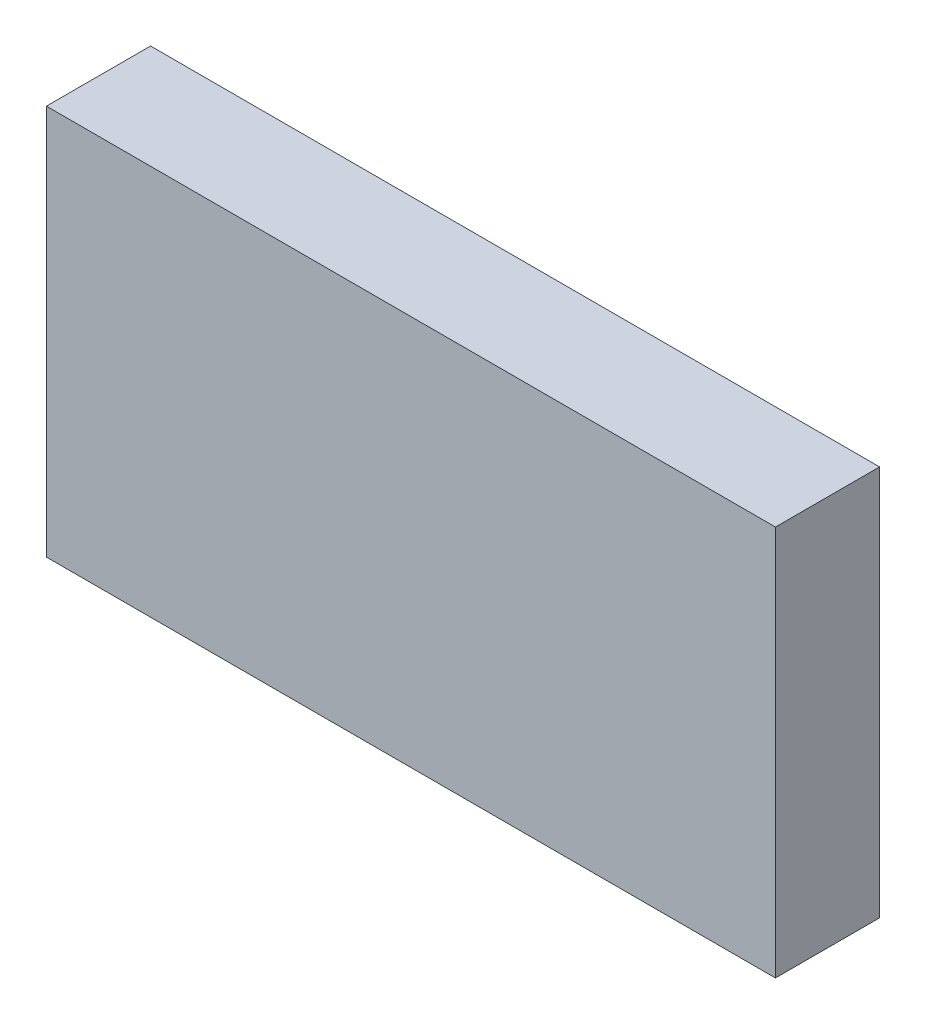
ISO-10303-21;
HEADER;
FILE_DESCRIPTION(('STEP AP214'),'2;1');
FILE_NAME('part.step','',(''),(''),'','','');
FILE_SCHEMA(('AUTOMOTIVE_DESIGN { 1 0 10303 214 1 1 1 1 }'));
ENDSEC;
DATA;
#1=APPLICATION_CONTEXT('core data for automotive mechanical design processes');
#2=APPLICATION_PROTOCOL_DEFINITION('international standard','automotive_design',2000,#1);
#3=PRODUCT_CONTEXT('',#1,'mechanical');
#4=PRODUCT('Part','Part','',(#3));
#5=PRODUCT_RELATED_PRODUCT_CATEGORY('part','',(#4));
#6=PRODUCT_DEFINITION_FORMATION('','',#4);
#7=PRODUCT_DEFINITION_CONTEXT('part definition',#1,'design');
#8=PRODUCT_DEFINITION('design','',#6,#7);
#9=PRODUCT_DEFINITION_SHAPE('','',#8);
#10=(LENGTH_UNIT() NAMED_UNIT(*) SI_UNIT(.MILLI.,.METRE.));
#11=(NAMED_UNIT(*) PLANE_ANGLE_UNIT() SI_UNIT($,.RADIAN.));
#12=(NAMED_UNIT(*) SI_UNIT($,.STERADIAN.) SOLID_ANGLE_UNIT());
#13=UNCERTAINTY_MEASURE_WITH_UNIT(LENGTH_MEASURE(1.E-05),#10,'distance_accuracy_value','');
#14=(GEOMETRIC_REPRESENTATION_CONTEXT(3) GLOBAL_UNCERTAINTY_ASSIGNED_CONTEXT((#13)) GLOBAL_UNIT_ASSIGNED_CONTEXT((#10,
#11,#12)) REPRESENTATION_CONTEXT('',''));
#15=CARTESIAN_POINT('',(0.,0.,0.));
#16=DIRECTION('',(0.,0.,1.));
#17=DIRECTION('',(1.,0.,0.));
#18=AXIS2_PLACEMENT_3D('',#15,#16,#17);
#19=CARTESIAN_POINT('',(-0.591343297244659,-0.749996420067804,0.0826433070866142));
#20=DIRECTION('',(0.,0.,-1.));
#21=DIRECTION('',(0.,1.,0.));
#22=AXIS2_PLACEMENT_3D('',#19,#20,#21);
#23=PLANE('',#22);
#24=DIRECTION('',(0.,1.,0.));
#25=VECTOR('',#24,1.);
#26=CARTESIAN_POINT('',(-0.587815738189541,-0.749996420067804,0.0826433070866142));
#27=LINE('',#26,#25);
#28=CARTESIAN_POINT('',(-0.587815738189541,-0.710311380697725,0.0826433070866142));
#29=VERTEX_POINT('',#28);
#30=CARTESIAN_POINT('',(-0.587815738189541,-0.748106656288277,0.0826433070866142));
#31=VERTEX_POINT('',#30);
#32=EDGE_CURVE('E71',#29,#31,#27,.F.);
#33=ORIENTED_EDGE('',*,*,#32,.T.);
#34=DIRECTION('',(1.,0.,0.));
#35=VECTOR('',#34,1.);
#36=CARTESIAN_POINT('',(-0.513736998032061,-0.748106656288277,0.0826433070866142));
#37=LINE('',#36,#35);
#38=CARTESIAN_POINT('',(-0.517264557087179,-0.748106656288277,0.0826433070866142));
#39=VERTEX_POINT('',#38);
#40=EDGE_CURVE('E54',#39,#31,#37,.F.);
#41=ORIENTED_EDGE('',*,*,#40,.F.);
#42=DIRECTION('',(0.,1.,0.));
#43=VECTOR('',#42,1.);
#44=CARTESIAN_POINT('',(-0.517264557087179,-0.749996420067804,0.0826433070866142));
#45=LINE('',#44,#43);
#46=CARTESIAN_POINT('',(-0.517264557087179,-0.710311380697725,0.0826433070866142));
#47=VERTEX_POINT('',#46);
#48=EDGE_CURVE('E20',#47,#39,#45,.F.);
#49=ORIENTED_EDGE('',*,*,#48,.F.);
#50=DIRECTION('',(1.,0.,0.));
#51=VECTOR('',#50,1.);
#52=CARTESIAN_POINT('',(-0.513736998032061,-0.710311380697725,0.0826433070866142));
#53=LINE('',#52,#51);
#54=EDGE_CURVE('E81',#29,#47,#53,.T.);
#55=ORIENTED_EDGE('',*,*,#54,.F.);
#56=EDGE_LOOP('',(#33,#41,#49,#55));
#57=FACE_BOUND('',#56,.T.);
#58=ADVANCED_FACE('F17',(#57),#23,.F.);
#59=CARTESIAN_POINT('',(-0.517264557087179,-0.749996420067804,0.0720606299212598));
#60=DIRECTION('',(-1.,0.,0.));
#61=DIRECTION('',(0.,0.,1.));
#62=AXIS2_PLACEMENT_3D('',#59,#60,#61);
#63=PLANE('',#62);
#64=DIRECTION('',(0.,0.,-1.));
#65=VECTOR('',#64,1.);
#66=CARTESIAN_POINT('',(-0.517264557087179,-0.710311380697725,0.0831472440944882));
#67=LINE('',#66,#65);
#68=CARTESIAN_POINT('',(-0.517264557087179,-0.710311380697725,0.0725645669291339));
#69=VERTEX_POINT('',#68);
#70=EDGE_CURVE('E64',#47,#69,#67,.T.);
#71=ORIENTED_EDGE('',*,*,#70,.F.);
#72=ORIENTED_EDGE('',*,*,#48,.T.);
#73=DIRECTION('',(0.,0.,1.));
#74=VECTOR('',#73,1.);
#75=CARTESIAN_POINT('',(-0.517264557087179,-0.748106656288277,0.0720606299212598));
#76=LINE('',#75,#74);
#77=CARTESIAN_POINT('',(-0.517264557087179,-0.748106656288277,0.0725645669291339));
#78=VERTEX_POINT('',#77);
#79=EDGE_CURVE('E62',#78,#39,#76,.T.);
#80=ORIENTED_EDGE('',*,*,#79,.F.);
#81=DIRECTION('',(0.,-1.,0.));
#82=VECTOR('',#81,1.);
#83=CARTESIAN_POINT('',(-0.517264557087179,-0.749996420067804,0.0725645669291339));
#84=LINE('',#83,#82);
#85=EDGE_CURVE('E83',#69,#78,#84,.T.);
#86=ORIENTED_EDGE('',*,*,#85,.F.);
#87=EDGE_LOOP('',(#71,#72,#80,#86));
#88=FACE_BOUND('',#87,.T.);
#89=ADVANCED_FACE('F60',(#88),#63,.F.);
#90=CARTESIAN_POINT('',(-0.513736998032061,-0.748106656288277,0.0720606299212598));
#91=DIRECTION('',(0.,1.,0.));
#92=DIRECTION('',(0.,0.,1.));
#93=AXIS2_PLACEMENT_3D('',#90,#91,#92);
#94=PLANE('',#93);
#95=DIRECTION('',(0.,0.,1.));
#96=VECTOR('',#95,1.);
#97=CARTESIAN_POINT('',(-0.587815738189541,-0.748106656288277,0.0720606299212598));
#98=LINE('',#97,#96);
#99=CARTESIAN_POINT('',(-0.587815738189541,-0.748106656288277,0.0725645669291339));
#100=VERTEX_POINT('',#99);
#101=EDGE_CURVE('E73',#31,#100,#98,.F.);
#102=ORIENTED_EDGE('',*,*,#101,.T.);
#103=DIRECTION('',(1.,0.,0.));
#104=VECTOR('',#103,1.);
#105=CARTESIAN_POINT('',(-0.513736998032061,-0.748106656288277,0.0725645669291339));
#106=LINE('',#105,#104);
#107=EDGE_CURVE('E69',#78,#100,#106,.F.);
#108=ORIENTED_EDGE('',*,*,#107,.F.);
#109=ORIENTED_EDGE('',*,*,#79,.T.);
#110=ORIENTED_EDGE('',*,*,#40,.T.);
#111=EDGE_LOOP('',(#102,#108,#109,#110));
#112=FACE_BOUND('',#111,.T.);
#113=ADVANCED_FACE('F68',(#112),#94,.F.);
#114=CARTESIAN_POINT('',(-0.587815738189541,-0.749996420067804,0.0720606299212598));
#115=DIRECTION('',(-1.,0.,0.));
#116=DIRECTION('',(0.,0.,1.));
#117=AXIS2_PLACEMENT_3D('',#114,#115,#116);
#118=PLANE('',#117);
#119=ORIENTED_EDGE('',*,*,#32,.F.);
#120=DIRECTION('',(0.,0.,-1.));
#121=VECTOR('',#120,1.);
#122=CARTESIAN_POINT('',(-0.587815738189541,-0.710311380697725,0.0831472440944882));
#123=LINE('',#122,#121);
#124=CARTESIAN_POINT('',(-0.587815738189541,-0.710311380697725,0.0725645669291339));
#125=VERTEX_POINT('',#124);
#126=EDGE_CURVE('E78',#125,#29,#123,.F.);
#127=ORIENTED_EDGE('',*,*,#126,.F.);
#128=DIRECTION('',(0.,-1.,0.));
#129=VECTOR('',#128,1.);
#130=CARTESIAN_POINT('',(-0.587815738189541,-0.749996420067804,0.0725645669291339));
#131=LINE('',#130,#129);
#132=EDGE_CURVE('E26',#100,#125,#131,.F.);
#133=ORIENTED_EDGE('',*,*,#132,.F.);
#134=ORIENTED_EDGE('',*,*,#101,.F.);
#135=EDGE_LOOP('',(#119,#127,#133,#134));
#136=FACE_BOUND('',#135,.T.);
#137=ADVANCED_FACE('F88',(#136),#118,.T.);
#138=CARTESIAN_POINT('',(-0.513736998032061,-0.710311380697725,0.0831472440944882));
#139=DIRECTION('',(0.,-1.,0.));
#140=DIRECTION('',(0.,0.,-1.));
#141=AXIS2_PLACEMENT_3D('',#138,#139,#140);
#142=PLANE('',#141);
#143=ORIENTED_EDGE('',*,*,#126,.T.);
#144=ORIENTED_EDGE('',*,*,#54,.T.);
#145=ORIENTED_EDGE('',*,*,#70,.T.);
#146=DIRECTION('',(1.,0.,0.));
#147=VECTOR('',#146,1.);
#148=CARTESIAN_POINT('',(-0.513736998032061,-0.710311380697725,0.0725645669291339));
#149=LINE('',#148,#147);
#150=EDGE_CURVE('E11',#125,#69,#149,.T.);
#151=ORIENTED_EDGE('',*,*,#150,.F.);
#152=EDGE_LOOP('',(#143,#144,#145,#151));
#153=FACE_BOUND('',#152,.T.);
#154=ADVANCED_FACE('F91',(#153),#142,.F.);
#155=CARTESIAN_POINT('',(-0.513736998032061,-0.749996420067804,0.0725645669291339));
#156=DIRECTION('',(0.,0.,1.));
#157=DIRECTION('',(0.,-1.,0.));
#158=AXIS2_PLACEMENT_3D('',#155,#156,#157);
#159=PLANE('',#158);
#160=ORIENTED_EDGE('',*,*,#132,.T.);
#161=ORIENTED_EDGE('',*,*,#150,.T.);
#162=ORIENTED_EDGE('',*,*,#85,.T.);
#163=ORIENTED_EDGE('',*,*,#107,.T.);
#164=EDGE_LOOP('',(#160,#161,#162,#163));
#165=FACE_BOUND('',#164,.T.);
#166=ADVANCED_FACE('F86',(#165),#159,.F.);
#167=CLOSED_SHELL('',(#58,#89,#113,#137,#154,#166));
#168=MANIFOLD_SOLID_BREP('B1',#167);
#169=ADVANCED_BREP_SHAPE_REPRESENTATION('',(#18,#168),#14);
#170=SHAPE_DEFINITION_REPRESENTATION(#9,#169);
ENDSEC;
END-ISO-10303-21;
